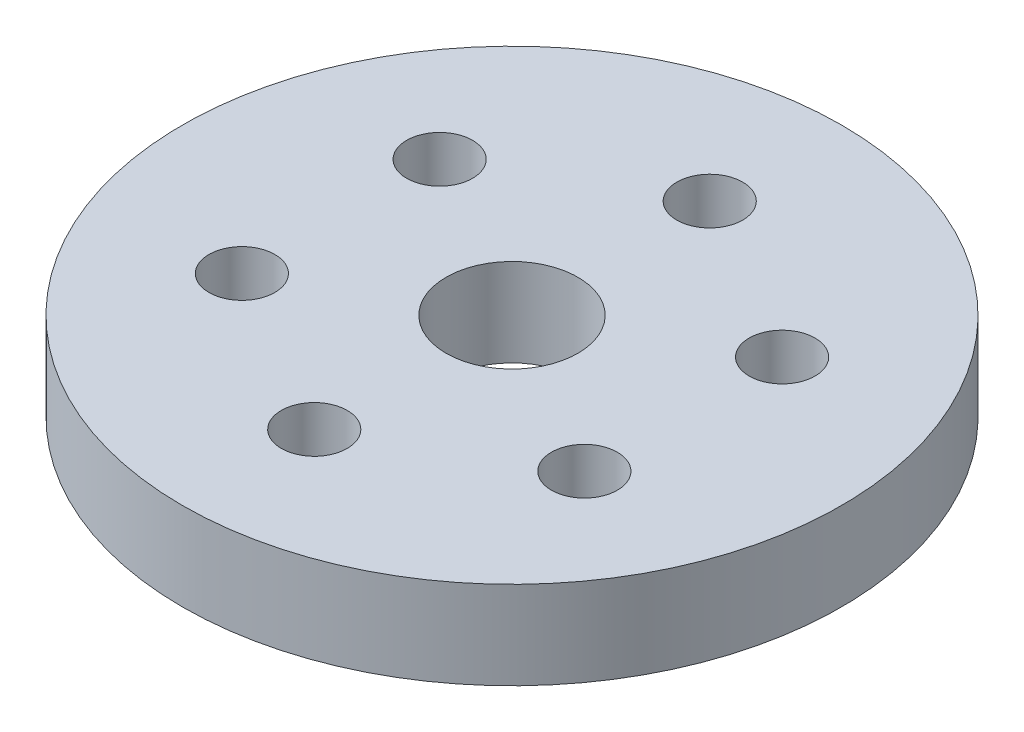
ISO-10303-21;
HEADER;
FILE_DESCRIPTION(('STEP AP214'),'2;1');
FILE_NAME('part.step','',(''),(''),'','','');
FILE_SCHEMA(('AUTOMOTIVE_DESIGN { 1 0 10303 214 1 1 1 1 }'));
ENDSEC;
DATA;
#1=APPLICATION_CONTEXT('core data for automotive mechanical design processes');
#2=APPLICATION_PROTOCOL_DEFINITION('international standard','automotive_design',2000,#1);
#3=PRODUCT_CONTEXT('',#1,'mechanical');
#4=PRODUCT('Part','Part','',(#3));
#5=PRODUCT_RELATED_PRODUCT_CATEGORY('part','',(#4));
#6=PRODUCT_DEFINITION_FORMATION('','',#4);
#7=PRODUCT_DEFINITION_CONTEXT('part definition',#1,'design');
#8=PRODUCT_DEFINITION('design','',#6,#7);
#9=PRODUCT_DEFINITION_SHAPE('','',#8);
#10=(LENGTH_UNIT() NAMED_UNIT(*) SI_UNIT(.MILLI.,.METRE.));
#11=(NAMED_UNIT(*) PLANE_ANGLE_UNIT() SI_UNIT($,.RADIAN.));
#12=(NAMED_UNIT(*) SI_UNIT($,.STERADIAN.) SOLID_ANGLE_UNIT());
#13=UNCERTAINTY_MEASURE_WITH_UNIT(LENGTH_MEASURE(1.E-05),#10,'distance_accuracy_value','');
#14=(GEOMETRIC_REPRESENTATION_CONTEXT(3) GLOBAL_UNCERTAINTY_ASSIGNED_CONTEXT((#13)) GLOBAL_UNIT_ASSIGNED_CONTEXT((#10,
#11,#12)) REPRESENTATION_CONTEXT('',''));
#15=CARTESIAN_POINT('',(0.,0.,0.));
#16=DIRECTION('',(0.,0.,1.));
#17=DIRECTION('',(1.,0.,0.));
#18=AXIS2_PLACEMENT_3D('',#15,#16,#17);
#19=CARTESIAN_POINT('',(0.,2.11666666666667,0.));
#20=DIRECTION('',(0.,1.,0.));
#21=DIRECTION('',(0.,0.,1.));
#22=AXIS2_PLACEMENT_3D('',#19,#20,#21);
#23=PLANE('',#22);
#24=CARTESIAN_POINT('',(-8.24889197104678,2.11666666666667,-4.7625));
#25=DIRECTION('',(0.,1.,0.));
#26=DIRECTION('',(0.,0.,1.));
#27=AXIS2_PLACEMENT_3D('',#24,#25,#26);
#28=CIRCLE('',#27,1.5875);
#29=CARTESIAN_POINT('',(-8.24889197104678,2.11666666666667,-3.175));
#30=VERTEX_POINT('',#29);
#31=EDGE_CURVE('E82',#30,#30,#28,.T.);
#32=ORIENTED_EDGE('',*,*,#31,.F.);
#33=EDGE_LOOP('',(#32));
#34=FACE_BOUND('',#33,.T.);
#35=CARTESIAN_POINT('',(-8.24889197104678,2.11666666666667,4.7625));
#36=DIRECTION('',(0.,1.,0.));
#37=DIRECTION('',(0.,0.,1.));
#38=AXIS2_PLACEMENT_3D('',#35,#36,#37);
#39=CIRCLE('',#38,1.5875);
#40=CARTESIAN_POINT('',(-8.24889197104678,2.11666666666667,6.35));
#41=VERTEX_POINT('',#40);
#42=EDGE_CURVE('E76',#41,#41,#39,.T.);
#43=ORIENTED_EDGE('',*,*,#42,.F.);
#44=EDGE_LOOP('',(#43));
#45=FACE_BOUND('',#44,.T.);
#46=CARTESIAN_POINT('',(0.,2.11666666666667,9.525));
#47=DIRECTION('',(0.,1.,0.));
#48=DIRECTION('',(0.,0.,1.));
#49=AXIS2_PLACEMENT_3D('',#46,#47,#48);
#50=CIRCLE('',#49,1.5875);
#51=CARTESIAN_POINT('',(0.,2.11666666666667,11.1125));
#52=VERTEX_POINT('',#51);
#53=EDGE_CURVE('E70',#52,#52,#50,.T.);
#54=ORIENTED_EDGE('',*,*,#53,.F.);
#55=EDGE_LOOP('',(#54));
#56=FACE_BOUND('',#55,.T.);
#57=CARTESIAN_POINT('',(8.24889197104678,2.11666666666667,4.7625));
#58=DIRECTION('',(0.,1.,0.));
#59=DIRECTION('',(0.,0.,1.));
#60=AXIS2_PLACEMENT_3D('',#57,#58,#59);
#61=CIRCLE('',#60,1.5875);
#62=CARTESIAN_POINT('',(8.24889197104678,2.11666666666667,6.35));
#63=VERTEX_POINT('',#62);
#64=EDGE_CURVE('E64',#63,#63,#61,.T.);
#65=ORIENTED_EDGE('',*,*,#64,.F.);
#66=EDGE_LOOP('',(#65));
#67=FACE_BOUND('',#66,.T.);
#68=CARTESIAN_POINT('',(8.24889197104678,2.11666666666667,-4.7625));
#69=DIRECTION('',(0.,1.,0.));
#70=DIRECTION('',(0.,0.,1.));
#71=AXIS2_PLACEMENT_3D('',#68,#69,#70);
#72=CIRCLE('',#71,1.5875);
#73=CARTESIAN_POINT('',(8.24889197104678,2.11666666666667,-3.175));
#74=VERTEX_POINT('',#73);
#75=EDGE_CURVE('E58',#74,#74,#72,.T.);
#76=ORIENTED_EDGE('',*,*,#75,.F.);
#77=EDGE_LOOP('',(#76));
#78=FACE_BOUND('',#77,.T.);
#79=CARTESIAN_POINT('',(0.,2.11666666666667,-9.525));
#80=DIRECTION('',(0.,1.,0.));
#81=DIRECTION('',(0.,0.,1.));
#82=AXIS2_PLACEMENT_3D('',#79,#80,#81);
#83=CIRCLE('',#82,1.5875);
#84=CARTESIAN_POINT('',(0.,2.11666666666667,-7.9375));
#85=VERTEX_POINT('',#84);
#86=EDGE_CURVE('E52',#85,#85,#83,.T.);
#87=ORIENTED_EDGE('',*,*,#86,.F.);
#88=EDGE_LOOP('',(#87));
#89=FACE_BOUND('',#88,.T.);
#90=CARTESIAN_POINT('',(0.,2.11666666666667,0.));
#91=DIRECTION('',(0.,1.,0.));
#92=DIRECTION('',(0.,0.,1.));
#93=AXIS2_PLACEMENT_3D('',#90,#91,#92);
#94=CIRCLE('',#93,15.875);
#95=CARTESIAN_POINT('',(0.,2.11666666666667,15.875));
#96=VERTEX_POINT('',#95);
#97=EDGE_CURVE('E10',#96,#96,#94,.T.);
#98=ORIENTED_EDGE('',*,*,#97,.T.);
#99=EDGE_LOOP('',(#98));
#100=FACE_BOUND('',#99,.T.);
#101=CARTESIAN_POINT('',(0.,2.11666666666667,0.));
#102=DIRECTION('',(0.,1.,0.));
#103=DIRECTION('',(0.,0.,1.));
#104=AXIS2_PLACEMENT_3D('',#101,#102,#103);
#105=CIRCLE('',#104,3.175);
#106=CARTESIAN_POINT('',(0.,2.11666666666667,3.175));
#107=VERTEX_POINT('',#106);
#108=EDGE_CURVE('E42',#107,#107,#105,.T.);
#109=ORIENTED_EDGE('',*,*,#108,.F.);
#110=EDGE_LOOP('',(#109));
#111=FACE_BOUND('',#110,.T.);
#112=ADVANCED_FACE('F31',(#34,#45,#56,#67,#78,#89,#100,#111),#23,.T.);
#113=CARTESIAN_POINT('',(0.,-2.11666666666667,0.));
#114=DIRECTION('',(0.,1.,0.));
#115=DIRECTION('',(0.,0.,1.));
#116=AXIS2_PLACEMENT_3D('',#113,#114,#115);
#117=PLANE('',#116);
#118=CARTESIAN_POINT('',(-8.24889197104678,-2.11666666666667,-4.7625));
#119=DIRECTION('',(0.,1.,0.));
#120=DIRECTION('',(0.,0.,1.));
#121=AXIS2_PLACEMENT_3D('',#118,#119,#120);
#122=CIRCLE('',#121,1.5875);
#123=CARTESIAN_POINT('',(-8.24889197104678,-2.11666666666667,-3.175));
#124=VERTEX_POINT('',#123);
#125=EDGE_CURVE('E79',#124,#124,#122,.T.);
#126=ORIENTED_EDGE('',*,*,#125,.T.);
#127=EDGE_LOOP('',(#126));
#128=FACE_BOUND('',#127,.T.);
#129=CARTESIAN_POINT('',(-8.24889197104678,-2.11666666666667,4.7625));
#130=DIRECTION('',(0.,1.,0.));
#131=DIRECTION('',(0.,0.,1.));
#132=AXIS2_PLACEMENT_3D('',#129,#130,#131);
#133=CIRCLE('',#132,1.5875);
#134=CARTESIAN_POINT('',(-8.24889197104678,-2.11666666666667,6.35));
#135=VERTEX_POINT('',#134);
#136=EDGE_CURVE('E73',#135,#135,#133,.T.);
#137=ORIENTED_EDGE('',*,*,#136,.T.);
#138=EDGE_LOOP('',(#137));
#139=FACE_BOUND('',#138,.T.);
#140=CARTESIAN_POINT('',(0.,-2.11666666666667,9.525));
#141=DIRECTION('',(0.,1.,0.));
#142=DIRECTION('',(0.,0.,1.));
#143=AXIS2_PLACEMENT_3D('',#140,#141,#142);
#144=CIRCLE('',#143,1.5875);
#145=CARTESIAN_POINT('',(0.,-2.11666666666667,11.1125));
#146=VERTEX_POINT('',#145);
#147=EDGE_CURVE('E67',#146,#146,#144,.T.);
#148=ORIENTED_EDGE('',*,*,#147,.T.);
#149=EDGE_LOOP('',(#148));
#150=FACE_BOUND('',#149,.T.);
#151=CARTESIAN_POINT('',(8.24889197104678,-2.11666666666667,4.7625));
#152=DIRECTION('',(0.,1.,0.));
#153=DIRECTION('',(0.,0.,1.));
#154=AXIS2_PLACEMENT_3D('',#151,#152,#153);
#155=CIRCLE('',#154,1.5875);
#156=CARTESIAN_POINT('',(8.24889197104678,-2.11666666666667,6.35));
#157=VERTEX_POINT('',#156);
#158=EDGE_CURVE('E61',#157,#157,#155,.T.);
#159=ORIENTED_EDGE('',*,*,#158,.T.);
#160=EDGE_LOOP('',(#159));
#161=FACE_BOUND('',#160,.T.);
#162=CARTESIAN_POINT('',(8.24889197104678,-2.11666666666667,-4.7625));
#163=DIRECTION('',(0.,1.,0.));
#164=DIRECTION('',(0.,0.,1.));
#165=AXIS2_PLACEMENT_3D('',#162,#163,#164);
#166=CIRCLE('',#165,1.5875);
#167=CARTESIAN_POINT('',(8.24889197104678,-2.11666666666667,-3.175));
#168=VERTEX_POINT('',#167);
#169=EDGE_CURVE('E55',#168,#168,#166,.T.);
#170=ORIENTED_EDGE('',*,*,#169,.T.);
#171=EDGE_LOOP('',(#170));
#172=FACE_BOUND('',#171,.T.);
#173=CARTESIAN_POINT('',(0.,-2.11666666666667,-9.525));
#174=DIRECTION('',(0.,1.,0.));
#175=DIRECTION('',(0.,0.,1.));
#176=AXIS2_PLACEMENT_3D('',#173,#174,#175);
#177=CIRCLE('',#176,1.5875);
#178=CARTESIAN_POINT('',(0.,-2.11666666666667,-7.9375));
#179=VERTEX_POINT('',#178);
#180=EDGE_CURVE('E47',#179,#179,#177,.T.);
#181=ORIENTED_EDGE('',*,*,#180,.T.);
#182=EDGE_LOOP('',(#181));
#183=FACE_BOUND('',#182,.T.);
#184=CARTESIAN_POINT('',(0.,-2.11666666666667,0.));
#185=DIRECTION('',(0.,1.,0.));
#186=DIRECTION('',(0.,0.,1.));
#187=AXIS2_PLACEMENT_3D('',#184,#185,#186);
#188=CIRCLE('',#187,15.875);
#189=CARTESIAN_POINT('',(0.,-2.11666666666667,15.875));
#190=VERTEX_POINT('',#189);
#191=EDGE_CURVE('E35',#190,#190,#188,.T.);
#192=ORIENTED_EDGE('',*,*,#191,.F.);
#193=EDGE_LOOP('',(#192));
#194=FACE_BOUND('',#193,.T.);
#195=CARTESIAN_POINT('',(0.,-2.11666666666667,0.));
#196=DIRECTION('',(0.,1.,0.));
#197=DIRECTION('',(0.,0.,1.));
#198=AXIS2_PLACEMENT_3D('',#195,#196,#197);
#199=CIRCLE('',#198,3.175);
#200=CARTESIAN_POINT('',(0.,-2.11666666666667,3.175));
#201=VERTEX_POINT('',#200);
#202=EDGE_CURVE('E44',#201,#201,#199,.T.);
#203=ORIENTED_EDGE('',*,*,#202,.T.);
#204=EDGE_LOOP('',(#203));
#205=FACE_BOUND('',#204,.T.);
#206=ADVANCED_FACE('F90',(#128,#139,#150,#161,#172,#183,#194,#205),#117,.F.);
#207=CARTESIAN_POINT('',(0.,2.11666666666667,0.));
#208=DIRECTION('',(0.,-1.,0.));
#209=DIRECTION('',(0.,0.,-1.));
#210=AXIS2_PLACEMENT_3D('',#207,#208,#209);
#211=CYLINDRICAL_SURFACE('',#210,15.875);
#212=ORIENTED_EDGE('',*,*,#97,.F.);
#213=EDGE_LOOP('',(#212));
#214=FACE_BOUND('',#213,.T.);
#215=ORIENTED_EDGE('',*,*,#191,.T.);
#216=EDGE_LOOP('',(#215));
#217=FACE_BOUND('',#216,.T.);
#218=ADVANCED_FACE('F33',(#214,#217),#211,.T.);
#219=CARTESIAN_POINT('',(0.,2.11666666666667,0.));
#220=DIRECTION('',(0.,-1.,0.));
#221=DIRECTION('',(0.,0.,-1.));
#222=AXIS2_PLACEMENT_3D('',#219,#220,#221);
#223=CYLINDRICAL_SURFACE('',#222,3.175);
#224=ORIENTED_EDGE('',*,*,#108,.T.);
#225=EDGE_LOOP('',(#224));
#226=FACE_BOUND('',#225,.T.);
#227=ORIENTED_EDGE('',*,*,#202,.F.);
#228=EDGE_LOOP('',(#227));
#229=FACE_BOUND('',#228,.T.);
#230=ADVANCED_FACE('F104',(#226,#229),#223,.F.);
#231=CARTESIAN_POINT('',(0.,-2.11666666666667,-9.525));
#232=DIRECTION('',(0.,1.,0.));
#233=DIRECTION('',(0.,0.,1.));
#234=AXIS2_PLACEMENT_3D('',#231,#232,#233);
#235=CYLINDRICAL_SURFACE('',#234,1.5875);
#236=ORIENTED_EDGE('',*,*,#180,.F.);
#237=EDGE_LOOP('',(#236));
#238=FACE_BOUND('',#237,.T.);
#239=ORIENTED_EDGE('',*,*,#86,.T.);
#240=EDGE_LOOP('',(#239));
#241=FACE_BOUND('',#240,.T.);
#242=ADVANCED_FACE('F107',(#238,#241),#235,.F.);
#243=CARTESIAN_POINT('',(8.24889197104678,-2.11666666666667,-4.7625));
#244=DIRECTION('',(0.,1.,0.));
#245=DIRECTION('',(0.,0.,1.));
#246=AXIS2_PLACEMENT_3D('',#243,#244,#245);
#247=CYLINDRICAL_SURFACE('',#246,1.5875);
#248=ORIENTED_EDGE('',*,*,#169,.F.);
#249=EDGE_LOOP('',(#248));
#250=FACE_BOUND('',#249,.T.);
#251=ORIENTED_EDGE('',*,*,#75,.T.);
#252=EDGE_LOOP('',(#251));
#253=FACE_BOUND('',#252,.T.);
#254=ADVANCED_FACE('F121',(#250,#253),#247,.F.);
#255=CARTESIAN_POINT('',(8.24889197104678,-2.11666666666667,4.7625));
#256=DIRECTION('',(0.,1.,0.));
#257=DIRECTION('',(0.,0.,1.));
#258=AXIS2_PLACEMENT_3D('',#255,#256,#257);
#259=CYLINDRICAL_SURFACE('',#258,1.5875);
#260=ORIENTED_EDGE('',*,*,#158,.F.);
#261=EDGE_LOOP('',(#260));
#262=FACE_BOUND('',#261,.T.);
#263=ORIENTED_EDGE('',*,*,#64,.T.);
#264=EDGE_LOOP('',(#263));
#265=FACE_BOUND('',#264,.T.);
#266=ADVANCED_FACE('F125',(#262,#265),#259,.F.);
#267=CARTESIAN_POINT('',(0.,-2.11666666666667,9.525));
#268=DIRECTION('',(0.,1.,0.));
#269=DIRECTION('',(0.,0.,1.));
#270=AXIS2_PLACEMENT_3D('',#267,#268,#269);
#271=CYLINDRICAL_SURFACE('',#270,1.5875);
#272=ORIENTED_EDGE('',*,*,#147,.F.);
#273=EDGE_LOOP('',(#272));
#274=FACE_BOUND('',#273,.T.);
#275=ORIENTED_EDGE('',*,*,#53,.T.);
#276=EDGE_LOOP('',(#275));
#277=FACE_BOUND('',#276,.T.);
#278=ADVANCED_FACE('F129',(#274,#277),#271,.F.);
#279=CARTESIAN_POINT('',(-8.24889197104678,-2.11666666666667,4.7625));
#280=DIRECTION('',(0.,1.,0.));
#281=DIRECTION('',(0.,0.,1.));
#282=AXIS2_PLACEMENT_3D('',#279,#280,#281);
#283=CYLINDRICAL_SURFACE('',#282,1.5875);
#284=ORIENTED_EDGE('',*,*,#136,.F.);
#285=EDGE_LOOP('',(#284));
#286=FACE_BOUND('',#285,.T.);
#287=ORIENTED_EDGE('',*,*,#42,.T.);
#288=EDGE_LOOP('',(#287));
#289=FACE_BOUND('',#288,.T.);
#290=ADVANCED_FACE('F133',(#286,#289),#283,.F.);
#291=CARTESIAN_POINT('',(-8.24889197104678,-2.11666666666667,-4.7625));
#292=DIRECTION('',(0.,1.,0.));
#293=DIRECTION('',(0.,0.,1.));
#294=AXIS2_PLACEMENT_3D('',#291,#292,#293);
#295=CYLINDRICAL_SURFACE('',#294,1.5875);
#296=ORIENTED_EDGE('',*,*,#125,.F.);
#297=EDGE_LOOP('',(#296));
#298=FACE_BOUND('',#297,.T.);
#299=ORIENTED_EDGE('',*,*,#31,.T.);
#300=EDGE_LOOP('',(#299));
#301=FACE_BOUND('',#300,.T.);
#302=ADVANCED_FACE('F86',(#298,#301),#295,.F.);
#303=CLOSED_SHELL('',(#112,#206,#218,#230,#242,#254,#266,#278,#290,#302));
#304=MANIFOLD_SOLID_BREP('B2',#303);
#305=ADVANCED_BREP_SHAPE_REPRESENTATION('',(#18,#304),#14);
#306=SHAPE_DEFINITION_REPRESENTATION(#9,#305);
ENDSEC;
END-ISO-10303-21;
